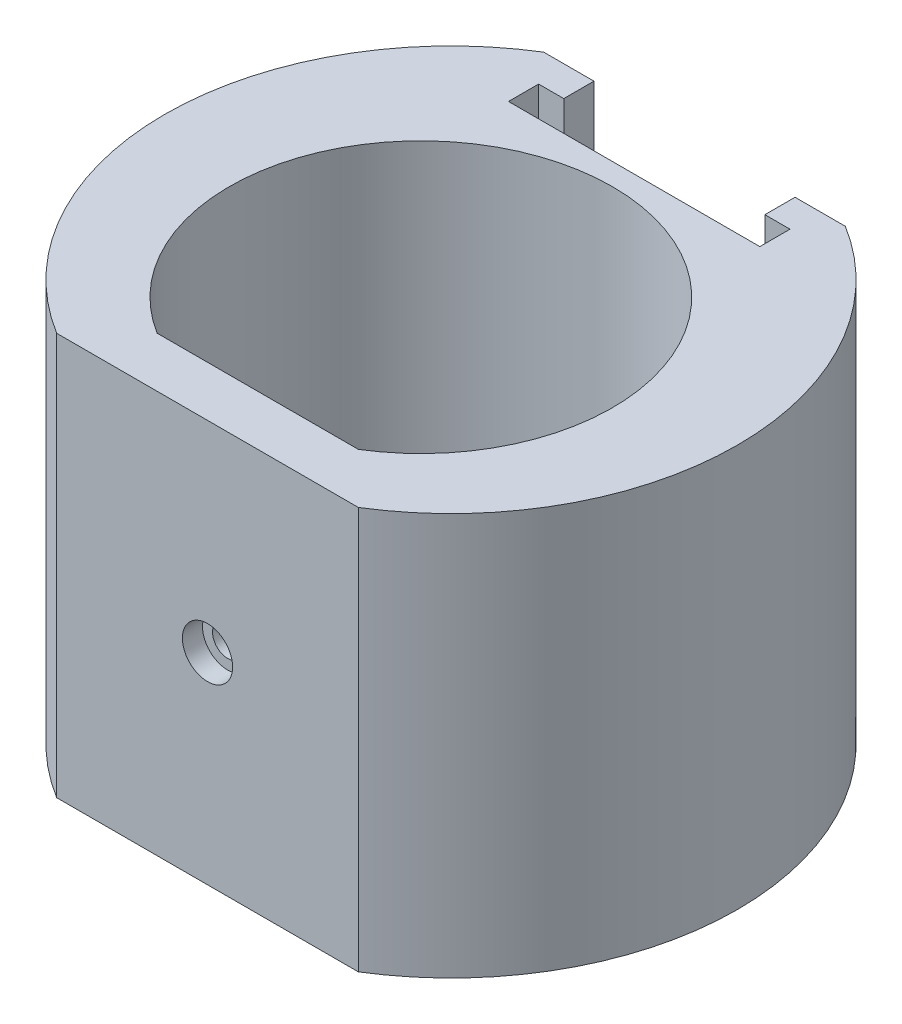
ISO-10303-21;
HEADER;
FILE_DESCRIPTION(('STEP AP214'),'2;1');
FILE_NAME('part.step','',(''),(''),'','','');
FILE_SCHEMA(('AUTOMOTIVE_DESIGN { 1 0 10303 214 1 1 1 1 }'));
ENDSEC;
DATA;
#1=APPLICATION_CONTEXT('core data for automotive mechanical design processes');
#2=APPLICATION_PROTOCOL_DEFINITION('international standard','automotive_design',2000,#1);
#3=PRODUCT_CONTEXT('',#1,'mechanical');
#4=PRODUCT('Part','Part','',(#3));
#5=PRODUCT_RELATED_PRODUCT_CATEGORY('part','',(#4));
#6=PRODUCT_DEFINITION_FORMATION('','',#4);
#7=PRODUCT_DEFINITION_CONTEXT('part definition',#1,'design');
#8=PRODUCT_DEFINITION('design','',#6,#7);
#9=PRODUCT_DEFINITION_SHAPE('','',#8);
#10=(LENGTH_UNIT() NAMED_UNIT(*) SI_UNIT(.MILLI.,.METRE.));
#11=(NAMED_UNIT(*) PLANE_ANGLE_UNIT() SI_UNIT($,.RADIAN.));
#12=(NAMED_UNIT(*) SI_UNIT($,.STERADIAN.) SOLID_ANGLE_UNIT());
#13=UNCERTAINTY_MEASURE_WITH_UNIT(LENGTH_MEASURE(1.E-05),#10,'distance_accuracy_value','');
#14=(GEOMETRIC_REPRESENTATION_CONTEXT(3) GLOBAL_UNCERTAINTY_ASSIGNED_CONTEXT((#13)) GLOBAL_UNIT_ASSIGNED_CONTEXT((#10,
#11,#12)) REPRESENTATION_CONTEXT('',''));
#15=CARTESIAN_POINT('',(0.,0.,0.));
#16=DIRECTION('',(0.,0.,1.));
#17=DIRECTION('',(1.,0.,0.));
#18=AXIS2_PLACEMENT_3D('',#15,#16,#17);
#19=CARTESIAN_POINT('',(0.,0.,19.2142684077944));
#20=DIRECTION('',(0.,0.,1.));
#21=DIRECTION('',(1.,0.,0.));
#22=AXIS2_PLACEMENT_3D('',#19,#20,#21);
#23=PLANE('',#22);
#24=CARTESIAN_POINT('',(0.,0.,19.2142684077944));
#25=DIRECTION('',(0.,0.,1.));
#26=DIRECTION('',(1.,0.,0.));
#27=AXIS2_PLACEMENT_3D('',#24,#25,#26);
#28=CIRCLE('',#27,2.5);
#29=CARTESIAN_POINT('',(2.5,0.,19.2142684077944));
#30=VERTEX_POINT('',#29);
#31=EDGE_CURVE('E192',#30,#30,#28,.T.);
#32=ORIENTED_EDGE('',*,*,#31,.T.);
#33=EDGE_LOOP('',(#32));
#34=FACE_BOUND('',#33,.T.);
#35=CARTESIAN_POINT('',(0.,0.,19.2142684077944));
#36=DIRECTION('',(0.,0.,1.));
#37=DIRECTION('',(1.,0.,0.));
#38=AXIS2_PLACEMENT_3D('',#35,#36,#37);
#39=CIRCLE('',#38,1.5);
#40=CARTESIAN_POINT('',(1.5,0.,19.2142684077944));
#41=VERTEX_POINT('',#40);
#42=EDGE_CURVE('E20',#41,#41,#39,.F.);
#43=ORIENTED_EDGE('',*,*,#42,.T.);
#44=EDGE_LOOP('',(#43));
#45=FACE_BOUND('',#44,.T.);
#46=ADVANCED_FACE('F17',(#34,#45),#23,.T.);
#47=CARTESIAN_POINT('',(0.,0.,11.9716277206751));
#48=DIRECTION('',(0.,0.,1.));
#49=DIRECTION('',(1.,0.,0.));
#50=AXIS2_PLACEMENT_3D('',#47,#48,#49);
#51=CYLINDRICAL_SURFACE('',#50,1.5);
#52=ORIENTED_EDGE('',*,*,#42,.F.);
#53=EDGE_LOOP('',(#52));
#54=FACE_BOUND('',#53,.T.);
#55=CARTESIAN_POINT('',(0.,0.,16.2142684077944));
#56=DIRECTION('',(0.,0.,1.));
#57=DIRECTION('',(1.,0.,0.));
#58=AXIS2_PLACEMENT_3D('',#55,#56,#57);
#59=CIRCLE('',#58,1.5);
#60=CARTESIAN_POINT('',(1.5,0.,16.2142684077944));
#61=VERTEX_POINT('',#60);
#62=EDGE_CURVE('E188',#61,#61,#59,.T.);
#63=ORIENTED_EDGE('',*,*,#62,.F.);
#64=EDGE_LOOP('',(#63));
#65=FACE_BOUND('',#64,.T.);
#66=ADVANCED_FACE('F202',(#54,#65),#51,.F.);
#67=CARTESIAN_POINT('',(0.,0.,19.2142684077944));
#68=DIRECTION('',(0.,0.,1.));
#69=DIRECTION('',(1.,0.,0.));
#70=AXIS2_PLACEMENT_3D('',#67,#68,#69);
#71=CYLINDRICAL_SURFACE('',#70,2.5);
#72=ORIENTED_EDGE('',*,*,#31,.F.);
#73=EDGE_LOOP('',(#72));
#74=FACE_BOUND('',#73,.T.);
#75=CARTESIAN_POINT('',(0.,0.,21.2142684077944));
#76=DIRECTION('',(0.,0.,1.));
#77=DIRECTION('',(1.,0.,0.));
#78=AXIS2_PLACEMENT_3D('',#75,#76,#77);
#79=CIRCLE('',#78,2.5);
#80=CARTESIAN_POINT('',(2.5,0.,21.2142684077944));
#81=VERTEX_POINT('',#80);
#82=EDGE_CURVE('E180',#81,#81,#79,.T.);
#83=ORIENTED_EDGE('',*,*,#82,.T.);
#84=EDGE_LOOP('',(#83));
#85=FACE_BOUND('',#84,.T.);
#86=ADVANCED_FACE('F205',(#74,#85),#71,.F.);
#87=CARTESIAN_POINT('',(12.5,-7.5,-24.2142684077944));
#88=DIRECTION('',(0.,0.,-1.));
#89=DIRECTION('',(-1.,0.,0.));
#90=AXIS2_PLACEMENT_3D('',#87,#88,#89);
#91=PLANE('',#90);
#92=DIRECTION('',(0.,1.,0.));
#93=VECTOR('',#92,1.);
#94=CARTESIAN_POINT('',(10.,-7.5,-24.2142684077944));
#95=LINE('',#94,#93);
#96=CARTESIAN_POINT('',(10.,20.,-24.2142684077944));
#97=VERTEX_POINT('',#96);
#98=CARTESIAN_POINT('',(10.,-7.5,-24.2142684077944));
#99=VERTEX_POINT('',#98);
#100=EDGE_CURVE('E84',#97,#99,#95,.F.);
#101=ORIENTED_EDGE('',*,*,#100,.T.);
#102=DIRECTION('',(1.,0.,0.));
#103=VECTOR('',#102,1.);
#104=CARTESIAN_POINT('',(0.,-7.5,-24.2142684077944));
#105=LINE('',#104,#103);
#106=CARTESIAN_POINT('',(12.5,-7.5,-24.2142684077944));
#107=VERTEX_POINT('',#106);
#108=EDGE_CURVE('E123',#107,#99,#105,.F.);
#109=ORIENTED_EDGE('',*,*,#108,.F.);
#110=DIRECTION('',(0.,1.,0.));
#111=VECTOR('',#110,1.);
#112=CARTESIAN_POINT('',(12.5,-7.5,-24.2142684077944));
#113=LINE('',#112,#111);
#114=CARTESIAN_POINT('',(12.5,20.,-24.2142684077944));
#115=VERTEX_POINT('',#114);
#116=EDGE_CURVE('E118',#107,#115,#113,.T.);
#117=ORIENTED_EDGE('',*,*,#116,.T.);
#118=DIRECTION('',(1.,0.,0.));
#119=VECTOR('',#118,1.);
#120=CARTESIAN_POINT('',(0.,20.,-24.2142684077944));
#121=LINE('',#120,#119);
#122=EDGE_CURVE('E126',#97,#115,#121,.T.);
#123=ORIENTED_EDGE('',*,*,#122,.F.);
#124=EDGE_LOOP('',(#101,#109,#117,#123));
#125=FACE_BOUND('',#124,.T.);
#126=ADVANCED_FACE('F121',(#125),#91,.F.);
#127=CARTESIAN_POINT('',(12.5,-7.5,-21.2142684077944));
#128=DIRECTION('',(1.,0.,0.));
#129=DIRECTION('',(0.,0.,-1.));
#130=AXIS2_PLACEMENT_3D('',#127,#128,#129);
#131=PLANE('',#130);
#132=ORIENTED_EDGE('',*,*,#116,.F.);
#133=DIRECTION('',(0.,0.,1.));
#134=VECTOR('',#133,1.);
#135=CARTESIAN_POINT('',(12.5,-7.5,0.));
#136=LINE('',#135,#134);
#137=CARTESIAN_POINT('',(12.5,-7.5,-21.2142684077944));
#138=VERTEX_POINT('',#137);
#139=EDGE_CURVE('E144',#138,#107,#136,.F.);
#140=ORIENTED_EDGE('',*,*,#139,.F.);
#141=DIRECTION('',(0.,1.,0.));
#142=VECTOR('',#141,1.);
#143=CARTESIAN_POINT('',(12.5,-7.5,-21.2142684077944));
#144=LINE('',#143,#142);
#145=CARTESIAN_POINT('',(12.5,20.,-21.2142684077944));
#146=VERTEX_POINT('',#145);
#147=EDGE_CURVE('E196',#138,#146,#144,.T.);
#148=ORIENTED_EDGE('',*,*,#147,.T.);
#149=DIRECTION('',(0.,0.,1.));
#150=VECTOR('',#149,1.);
#151=CARTESIAN_POINT('',(12.5,20.,-3.));
#152=LINE('',#151,#150);
#153=EDGE_CURVE('E306',#115,#146,#152,.T.);
#154=ORIENTED_EDGE('',*,*,#153,.F.);
#155=EDGE_LOOP('',(#132,#140,#148,#154));
#156=FACE_BOUND('',#155,.T.);
#157=ADVANCED_FACE('F381',(#156),#131,.F.);
#158=CARTESIAN_POINT('',(-12.5,-7.5,-21.2142684077944));
#159=DIRECTION('',(0.,0.,1.));
#160=DIRECTION('',(1.,0.,0.));
#161=AXIS2_PLACEMENT_3D('',#158,#159,#160);
#162=PLANE('',#161);
#163=ORIENTED_EDGE('',*,*,#147,.F.);
#164=DIRECTION('',(1.,0.,0.));
#165=VECTOR('',#164,1.);
#166=CARTESIAN_POINT('',(0.,-7.5,-21.2142684077944));
#167=LINE('',#166,#165);
#168=CARTESIAN_POINT('',(-12.5,-7.5,-21.2142684077944));
#169=VERTEX_POINT('',#168);
#170=EDGE_CURVE('E146',#169,#138,#167,.T.);
#171=ORIENTED_EDGE('',*,*,#170,.F.);
#172=DIRECTION('',(0.,1.,0.));
#173=VECTOR('',#172,1.);
#174=CARTESIAN_POINT('',(-12.5,-7.5,-21.2142684077944));
#175=LINE('',#174,#173);
#176=CARTESIAN_POINT('',(-12.5,20.,-21.2142684077944));
#177=VERTEX_POINT('',#176);
#178=EDGE_CURVE('E293',#169,#177,#175,.T.);
#179=ORIENTED_EDGE('',*,*,#178,.T.);
#180=DIRECTION('',(1.,0.,0.));
#181=VECTOR('',#180,1.);
#182=CARTESIAN_POINT('',(0.,20.,-21.2142684077944));
#183=LINE('',#182,#181);
#184=EDGE_CURVE('E298',#146,#177,#183,.F.);
#185=ORIENTED_EDGE('',*,*,#184,.F.);
#186=EDGE_LOOP('',(#163,#171,#179,#185));
#187=FACE_BOUND('',#186,.T.);
#188=ADVANCED_FACE('F386',(#187),#162,.F.);
#189=CARTESIAN_POINT('',(-12.5,-7.5,-24.2142684077944));
#190=DIRECTION('',(-1.,0.,0.));
#191=DIRECTION('',(0.,0.,1.));
#192=AXIS2_PLACEMENT_3D('',#189,#190,#191);
#193=PLANE('',#192);
#194=ORIENTED_EDGE('',*,*,#178,.F.);
#195=DIRECTION('',(0.,0.,1.));
#196=VECTOR('',#195,1.);
#197=CARTESIAN_POINT('',(-12.5,-7.5,0.));
#198=LINE('',#197,#196);
#199=CARTESIAN_POINT('',(-12.5,-7.5,-24.2142684077944));
#200=VERTEX_POINT('',#199);
#201=EDGE_CURVE('E153',#200,#169,#198,.T.);
#202=ORIENTED_EDGE('',*,*,#201,.F.);
#203=DIRECTION('',(0.,1.,0.));
#204=VECTOR('',#203,1.);
#205=CARTESIAN_POINT('',(-12.5,-7.5,-24.2142684077944));
#206=LINE('',#205,#204);
#207=CARTESIAN_POINT('',(-12.5,20.,-24.2142684077944));
#208=VERTEX_POINT('',#207);
#209=EDGE_CURVE('E191',#200,#208,#206,.T.);
#210=ORIENTED_EDGE('',*,*,#209,.T.);
#211=DIRECTION('',(0.,0.,1.));
#212=VECTOR('',#211,1.);
#213=CARTESIAN_POINT('',(-12.5,20.,-3.));
#214=LINE('',#213,#212);
#215=EDGE_CURVE('E289',#177,#208,#214,.F.);
#216=ORIENTED_EDGE('',*,*,#215,.F.);
#217=EDGE_LOOP('',(#194,#202,#210,#216));
#218=FACE_BOUND('',#217,.T.);
#219=ADVANCED_FACE('F222',(#218),#193,.F.);
#220=CARTESIAN_POINT('',(-10.,-7.5,-24.2142684077944));
#221=DIRECTION('',(0.,0.,-1.));
#222=DIRECTION('',(-1.,0.,0.));
#223=AXIS2_PLACEMENT_3D('',#220,#221,#222);
#224=PLANE('',#223);
#225=ORIENTED_EDGE('',*,*,#209,.F.);
#226=DIRECTION('',(1.,0.,0.));
#227=VECTOR('',#226,1.);
#228=CARTESIAN_POINT('',(0.,-7.5,-24.2142684077944));
#229=LINE('',#228,#227);
#230=CARTESIAN_POINT('',(-10.,-7.5,-24.2142684077944));
#231=VERTEX_POINT('',#230);
#232=EDGE_CURVE('E156',#231,#200,#229,.F.);
#233=ORIENTED_EDGE('',*,*,#232,.F.);
#234=DIRECTION('',(0.,1.,0.));
#235=VECTOR('',#234,1.);
#236=CARTESIAN_POINT('',(-10.,-7.5,-24.2142684077944));
#237=LINE('',#236,#235);
#238=CARTESIAN_POINT('',(-10.,20.,-24.2142684077944));
#239=VERTEX_POINT('',#238);
#240=EDGE_CURVE('E129',#231,#239,#237,.T.);
#241=ORIENTED_EDGE('',*,*,#240,.T.);
#242=DIRECTION('',(1.,0.,0.));
#243=VECTOR('',#242,1.);
#244=CARTESIAN_POINT('',(0.,20.,-24.2142684077944));
#245=LINE('',#244,#243);
#246=EDGE_CURVE('E287',#208,#239,#245,.T.);
#247=ORIENTED_EDGE('',*,*,#246,.F.);
#248=EDGE_LOOP('',(#225,#233,#241,#247));
#249=FACE_BOUND('',#248,.T.);
#250=ADVANCED_FACE('F211',(#249),#224,.F.);
#251=CARTESIAN_POINT('',(-10.,20.,16.2142684077944));
#252=DIRECTION('',(0.,0.,-1.));
#253=DIRECTION('',(-1.,0.,0.));
#254=AXIS2_PLACEMENT_3D('',#251,#252,#253);
#255=PLANE('',#254);
#256=DIRECTION('',(1.,0.,0.));
#257=VECTOR('',#256,1.);
#258=CARTESIAN_POINT('',(0.,20.,16.2142684077944));
#259=LINE('',#258,#257);
#260=CARTESIAN_POINT('',(10.,20.,16.2142684077944));
#261=VERTEX_POINT('',#260);
#262=CARTESIAN_POINT('',(-10.,20.,16.2142684077944));
#263=VERTEX_POINT('',#262);
#264=EDGE_CURVE('E175',#261,#263,#259,.F.);
#265=ORIENTED_EDGE('',*,*,#264,.F.);
#266=DIRECTION('',(0.,-1.,0.));
#267=VECTOR('',#266,1.);
#268=CARTESIAN_POINT('',(10.,20.,16.2142684077944));
#269=LINE('',#268,#267);
#270=CARTESIAN_POINT('',(10.,-20.,16.2142684077944));
#271=VERTEX_POINT('',#270);
#272=EDGE_CURVE('E267',#261,#271,#269,.T.);
#273=ORIENTED_EDGE('',*,*,#272,.T.);
#274=DIRECTION('',(1.,0.,0.));
#275=VECTOR('',#274,1.);
#276=CARTESIAN_POINT('',(0.,-20.,16.2142684077944));
#277=LINE('',#276,#275);
#278=CARTESIAN_POINT('',(-10.,-20.,16.2142684077944));
#279=VERTEX_POINT('',#278);
#280=EDGE_CURVE('E186',#271,#279,#277,.F.);
#281=ORIENTED_EDGE('',*,*,#280,.T.);
#282=DIRECTION('',(0.,-1.,0.));
#283=VECTOR('',#282,1.);
#284=CARTESIAN_POINT('',(-10.,20.,16.2142684077944));
#285=LINE('',#284,#283);
#286=EDGE_CURVE('E190',#279,#263,#285,.F.);
#287=ORIENTED_EDGE('',*,*,#286,.T.);
#288=EDGE_LOOP('',(#265,#273,#281,#287));
#289=FACE_BOUND('',#288,.T.);
#290=ORIENTED_EDGE('',*,*,#62,.T.);
#291=EDGE_LOOP('',(#290));
#292=FACE_BOUND('',#291,.T.);
#293=ADVANCED_FACE('F208',(#289,#292),#255,.T.);
#294=CARTESIAN_POINT('',(0.,20.,0.));
#295=DIRECTION('',(0.,-1.,0.));
#296=DIRECTION('',(0.,0.,-1.));
#297=AXIS2_PLACEMENT_3D('',#294,#295,#296);
#298=CYLINDRICAL_SURFACE('',#297,19.05);
#299=CARTESIAN_POINT('',(0.,20.,0.));
#300=DIRECTION('',(0.,-1.,0.));
#301=DIRECTION('',(0.,0.,-1.));
#302=AXIS2_PLACEMENT_3D('',#299,#300,#301);
#303=CIRCLE('',#302,19.05);
#304=EDGE_CURVE('E171',#263,#261,#303,.T.);
#305=ORIENTED_EDGE('',*,*,#304,.F.);
#306=ORIENTED_EDGE('',*,*,#286,.F.);
#307=CARTESIAN_POINT('',(0.,-20.,0.));
#308=DIRECTION('',(0.,-1.,0.));
#309=DIRECTION('',(0.,0.,-1.));
#310=AXIS2_PLACEMENT_3D('',#307,#308,#309);
#311=CIRCLE('',#310,19.05);
#312=EDGE_CURVE('E183',#279,#271,#311,.T.);
#313=ORIENTED_EDGE('',*,*,#312,.T.);
#314=ORIENTED_EDGE('',*,*,#272,.F.);
#315=EDGE_LOOP('',(#305,#306,#313,#314));
#316=FACE_BOUND('',#315,.T.);
#317=ADVANCED_FACE('F210',(#316),#298,.F.);
#318=CARTESIAN_POINT('',(-10.,-7.5,-27.2142684077944));
#319=DIRECTION('',(-1.,0.,0.));
#320=DIRECTION('',(0.,0.,1.));
#321=AXIS2_PLACEMENT_3D('',#318,#319,#320);
#322=PLANE('',#321);
#323=ORIENTED_EDGE('',*,*,#240,.F.);
#324=DIRECTION('',(0.,0.,1.));
#325=VECTOR('',#324,1.);
#326=CARTESIAN_POINT('',(-10.,-7.5,0.));
#327=LINE('',#326,#325);
#328=CARTESIAN_POINT('',(-10.,-7.5,-27.2142684077944));
#329=VERTEX_POINT('',#328);
#330=EDGE_CURVE('E128',#329,#231,#327,.T.);
#331=ORIENTED_EDGE('',*,*,#330,.F.);
#332=DIRECTION('',(0.,1.,0.));
#333=VECTOR('',#332,1.);
#334=CARTESIAN_POINT('',(-10.,20.,-27.2142684077944));
#335=LINE('',#334,#333);
#336=CARTESIAN_POINT('',(-10.,20.,-27.2142684077944));
#337=VERTEX_POINT('',#336);
#338=EDGE_CURVE('E174',#329,#337,#335,.T.);
#339=ORIENTED_EDGE('',*,*,#338,.T.);
#340=DIRECTION('',(0.,0.,1.));
#341=VECTOR('',#340,1.);
#342=CARTESIAN_POINT('',(-10.,20.,-3.));
#343=LINE('',#342,#341);
#344=EDGE_CURVE('E264',#239,#337,#343,.F.);
#345=ORIENTED_EDGE('',*,*,#344,.F.);
#346=EDGE_LOOP('',(#323,#331,#339,#345));
#347=FACE_BOUND('',#346,.T.);
#348=ADVANCED_FACE('F219',(#347),#322,.F.);
#349=CARTESIAN_POINT('',(0.,20.,-3.));
#350=DIRECTION('',(0.,-1.,0.));
#351=DIRECTION('',(0.,0.,-1.));
#352=AXIS2_PLACEMENT_3D('',#349,#350,#351);
#353=CYLINDRICAL_SURFACE('',#352,28.4838690230929);
#354=CARTESIAN_POINT('',(0.,20.,-3.));
#355=DIRECTION('',(0.,-1.,0.));
#356=DIRECTION('',(0.,0.,-1.));
#357=AXIS2_PLACEMENT_3D('',#354,#355,#356);
#358=CIRCLE('',#357,28.4838690230929);
#359=CARTESIAN_POINT('',(15.,20.,21.2142684077944));
#360=VERTEX_POINT('',#359);
#361=CARTESIAN_POINT('',(15.,20.,-27.2142684077944));
#362=VERTEX_POINT('',#361);
#363=EDGE_CURVE('E176',#360,#362,#358,.F.);
#364=ORIENTED_EDGE('',*,*,#363,.F.);
#365=DIRECTION('',(0.,1.,0.));
#366=VECTOR('',#365,1.);
#367=CARTESIAN_POINT('',(15.,20.,21.2142684077944));
#368=LINE('',#367,#366);
#369=CARTESIAN_POINT('',(15.,-20.,21.2142684077944));
#370=VERTEX_POINT('',#369);
#371=EDGE_CURVE('E75',#360,#370,#368,.F.);
#372=ORIENTED_EDGE('',*,*,#371,.T.);
#373=CARTESIAN_POINT('',(0.,-20.,-3.));
#374=DIRECTION('',(0.,-1.,0.));
#375=DIRECTION('',(0.,0.,-1.));
#376=AXIS2_PLACEMENT_3D('',#373,#374,#375);
#377=CIRCLE('',#376,28.4838690230929);
#378=CARTESIAN_POINT('',(15.,-20.,-27.2142684077944));
#379=VERTEX_POINT('',#378);
#380=EDGE_CURVE('E140',#370,#379,#377,.F.);
#381=ORIENTED_EDGE('',*,*,#380,.T.);
#382=DIRECTION('',(0.,1.,0.));
#383=VECTOR('',#382,1.);
#384=CARTESIAN_POINT('',(15.,20.,-27.2142684077944));
#385=LINE('',#384,#383);
#386=EDGE_CURVE('E347',#379,#362,#385,.T.);
#387=ORIENTED_EDGE('',*,*,#386,.T.);
#388=EDGE_LOOP('',(#364,#372,#381,#387));
#389=FACE_BOUND('',#388,.T.);
#390=ADVANCED_FACE('F252',(#389),#353,.T.);
#391=CARTESIAN_POINT('',(10.,-7.5,-24.2142684077944));
#392=DIRECTION('',(1.,0.,0.));
#393=DIRECTION('',(0.,0.,-1.));
#394=AXIS2_PLACEMENT_3D('',#391,#392,#393);
#395=PLANE('',#394);
#396=DIRECTION('',(0.,1.,0.));
#397=VECTOR('',#396,1.);
#398=CARTESIAN_POINT('',(10.,20.,-27.2142684077944));
#399=LINE('',#398,#397);
#400=CARTESIAN_POINT('',(10.,20.,-27.2142684077944));
#401=VERTEX_POINT('',#400);
#402=CARTESIAN_POINT('',(10.,-7.5,-27.2142684077944));
#403=VERTEX_POINT('',#402);
#404=EDGE_CURVE('E136',#401,#403,#399,.F.);
#405=ORIENTED_EDGE('',*,*,#404,.T.);
#406=DIRECTION('',(0.,0.,1.));
#407=VECTOR('',#406,1.);
#408=CARTESIAN_POINT('',(10.,-7.5,0.));
#409=LINE('',#408,#407);
#410=EDGE_CURVE('E133',#99,#403,#409,.F.);
#411=ORIENTED_EDGE('',*,*,#410,.F.);
#412=ORIENTED_EDGE('',*,*,#100,.F.);
#413=DIRECTION('',(0.,0.,1.));
#414=VECTOR('',#413,1.);
#415=CARTESIAN_POINT('',(10.,20.,-3.));
#416=LINE('',#415,#414);
#417=EDGE_CURVE('E319',#401,#97,#416,.T.);
#418=ORIENTED_EDGE('',*,*,#417,.F.);
#419=EDGE_LOOP('',(#405,#411,#412,#418));
#420=FACE_BOUND('',#419,.T.);
#421=ADVANCED_FACE('F134',(#420),#395,.F.);
#422=CARTESIAN_POINT('',(0.,-7.5,0.));
#423=DIRECTION('',(0.,1.,0.));
#424=DIRECTION('',(0.,0.,1.));
#425=AXIS2_PLACEMENT_3D('',#422,#423,#424);
#426=PLANE('',#425);
#427=ORIENTED_EDGE('',*,*,#108,.T.);
#428=ORIENTED_EDGE('',*,*,#410,.T.);
#429=DIRECTION('',(1.,0.,0.));
#430=VECTOR('',#429,1.);
#431=CARTESIAN_POINT('',(-15.,-7.5,-27.2142684077944));
#432=LINE('',#431,#430);
#433=EDGE_CURVE('E170',#403,#329,#432,.F.);
#434=ORIENTED_EDGE('',*,*,#433,.T.);
#435=ORIENTED_EDGE('',*,*,#330,.T.);
#436=ORIENTED_EDGE('',*,*,#232,.T.);
#437=ORIENTED_EDGE('',*,*,#201,.T.);
#438=ORIENTED_EDGE('',*,*,#170,.T.);
#439=ORIENTED_EDGE('',*,*,#139,.T.);
#440=EDGE_LOOP('',(#427,#428,#434,#435,#436,#437,#438,#439));
#441=FACE_BOUND('',#440,.T.);
#442=ADVANCED_FACE('F142',(#441),#426,.T.);
#443=CARTESIAN_POINT('',(0.,-20.,-3.));
#444=DIRECTION('',(0.,1.,0.));
#445=DIRECTION('',(0.,0.,1.));
#446=AXIS2_PLACEMENT_3D('',#443,#444,#445);
#447=PLANE('',#446);
#448=ORIENTED_EDGE('',*,*,#312,.F.);
#449=ORIENTED_EDGE('',*,*,#280,.F.);
#450=EDGE_LOOP('',(#448,#449));
#451=FACE_BOUND('',#450,.T.);
#452=DIRECTION('',(-1.,0.,0.));
#453=VECTOR('',#452,1.);
#454=CARTESIAN_POINT('',(-15.,-20.,21.2142684077944));
#455=LINE('',#454,#453);
#456=CARTESIAN_POINT('',(-15.,-20.,21.2142684077944));
#457=VERTEX_POINT('',#456);
#458=EDGE_CURVE('E283',#370,#457,#455,.T.);
#459=ORIENTED_EDGE('',*,*,#458,.T.);
#460=CARTESIAN_POINT('',(0.,-20.,-3.));
#461=DIRECTION('',(0.,-1.,0.));
#462=DIRECTION('',(0.,0.,-1.));
#463=AXIS2_PLACEMENT_3D('',#460,#461,#462);
#464=CIRCLE('',#463,28.4838690230929);
#465=CARTESIAN_POINT('',(-15.,-20.,-27.2142684077944));
#466=VERTEX_POINT('',#465);
#467=EDGE_CURVE('E167',#466,#457,#464,.F.);
#468=ORIENTED_EDGE('',*,*,#467,.F.);
#469=DIRECTION('',(1.,0.,0.));
#470=VECTOR('',#469,1.);
#471=CARTESIAN_POINT('',(-15.,-20.,-27.2142684077944));
#472=LINE('',#471,#470);
#473=EDGE_CURVE('E344',#466,#379,#472,.T.);
#474=ORIENTED_EDGE('',*,*,#473,.T.);
#475=ORIENTED_EDGE('',*,*,#380,.F.);
#476=EDGE_LOOP('',(#459,#468,#474,#475));
#477=FACE_BOUND('',#476,.T.);
#478=ADVANCED_FACE('F243',(#451,#477),#447,.F.);
#479=CARTESIAN_POINT('',(-15.,20.,21.2142684077944));
#480=DIRECTION('',(0.,0.,-1.));
#481=DIRECTION('',(-1.,0.,0.));
#482=AXIS2_PLACEMENT_3D('',#479,#480,#481);
#483=PLANE('',#482);
#484=ORIENTED_EDGE('',*,*,#371,.F.);
#485=DIRECTION('',(1.,0.,0.));
#486=VECTOR('',#485,1.);
#487=CARTESIAN_POINT('',(0.,20.,21.2142684077944));
#488=LINE('',#487,#486);
#489=CARTESIAN_POINT('',(-15.,20.,21.2142684077944));
#490=VERTEX_POINT('',#489);
#491=EDGE_CURVE('E179',#490,#360,#488,.T.);
#492=ORIENTED_EDGE('',*,*,#491,.F.);
#493=DIRECTION('',(0.,-1.,0.));
#494=VECTOR('',#493,1.);
#495=CARTESIAN_POINT('',(-15.,20.,21.2142684077944));
#496=LINE('',#495,#494);
#497=EDGE_CURVE('E166',#457,#490,#496,.F.);
#498=ORIENTED_EDGE('',*,*,#497,.F.);
#499=ORIENTED_EDGE('',*,*,#458,.F.);
#500=EDGE_LOOP('',(#484,#492,#498,#499));
#501=FACE_BOUND('',#500,.T.);
#502=ORIENTED_EDGE('',*,*,#82,.F.);
#503=EDGE_LOOP('',(#502));
#504=FACE_BOUND('',#503,.T.);
#505=ADVANCED_FACE('F239',(#501,#504),#483,.F.);
#506=CARTESIAN_POINT('',(0.,20.,-3.));
#507=DIRECTION('',(0.,1.,0.));
#508=DIRECTION('',(0.,0.,1.));
#509=AXIS2_PLACEMENT_3D('',#506,#507,#508);
#510=PLANE('',#509);
#511=ORIENTED_EDGE('',*,*,#264,.T.);
#512=ORIENTED_EDGE('',*,*,#304,.T.);
#513=EDGE_LOOP('',(#511,#512));
#514=FACE_BOUND('',#513,.T.);
#515=ORIENTED_EDGE('',*,*,#363,.T.);
#516=DIRECTION('',(1.,0.,0.));
#517=VECTOR('',#516,1.);
#518=CARTESIAN_POINT('',(-15.,20.,-27.2142684077944));
#519=LINE('',#518,#517);
#520=EDGE_CURVE('E335',#362,#401,#519,.F.);
#521=ORIENTED_EDGE('',*,*,#520,.T.);
#522=ORIENTED_EDGE('',*,*,#417,.T.);
#523=ORIENTED_EDGE('',*,*,#122,.T.);
#524=ORIENTED_EDGE('',*,*,#153,.T.);
#525=ORIENTED_EDGE('',*,*,#184,.T.);
#526=ORIENTED_EDGE('',*,*,#215,.T.);
#527=ORIENTED_EDGE('',*,*,#246,.T.);
#528=ORIENTED_EDGE('',*,*,#344,.T.);
#529=DIRECTION('',(1.,0.,0.));
#530=VECTOR('',#529,1.);
#531=CARTESIAN_POINT('',(-15.,20.,-27.2142684077944));
#532=LINE('',#531,#530);
#533=CARTESIAN_POINT('',(-15.,20.,-27.2142684077944));
#534=VERTEX_POINT('',#533);
#535=EDGE_CURVE('E35',#337,#534,#532,.F.);
#536=ORIENTED_EDGE('',*,*,#535,.T.);
#537=CARTESIAN_POINT('',(0.,20.,-3.));
#538=DIRECTION('',(0.,-1.,0.));
#539=DIRECTION('',(0.,0.,-1.));
#540=AXIS2_PLACEMENT_3D('',#537,#538,#539);
#541=CIRCLE('',#540,28.4838690230929);
#542=EDGE_CURVE('E26',#490,#534,#541,.T.);
#543=ORIENTED_EDGE('',*,*,#542,.F.);
#544=ORIENTED_EDGE('',*,*,#491,.T.);
#545=EDGE_LOOP('',(#515,#521,#522,#523,#524,#525,#526,#527,#528,#536,#543,#544));
#546=FACE_BOUND('',#545,.T.);
#547=ADVANCED_FACE('F233',(#514,#546),#510,.T.);
#548=CARTESIAN_POINT('',(-15.,20.,-27.2142684077944));
#549=DIRECTION('',(0.,0.,1.));
#550=DIRECTION('',(1.,0.,0.));
#551=AXIS2_PLACEMENT_3D('',#548,#549,#550);
#552=PLANE('',#551);
#553=ORIENTED_EDGE('',*,*,#404,.F.);
#554=ORIENTED_EDGE('',*,*,#520,.F.);
#555=ORIENTED_EDGE('',*,*,#386,.F.);
#556=ORIENTED_EDGE('',*,*,#473,.F.);
#557=DIRECTION('',(0.,-1.,0.));
#558=VECTOR('',#557,1.);
#559=CARTESIAN_POINT('',(-15.,20.,-27.2142684077944));
#560=LINE('',#559,#558);
#561=EDGE_CURVE('E11',#534,#466,#560,.T.);
#562=ORIENTED_EDGE('',*,*,#561,.F.);
#563=ORIENTED_EDGE('',*,*,#535,.F.);
#564=ORIENTED_EDGE('',*,*,#338,.F.);
#565=ORIENTED_EDGE('',*,*,#433,.F.);
#566=EDGE_LOOP('',(#553,#554,#555,#556,#562,#563,#564,#565));
#567=FACE_BOUND('',#566,.T.);
#568=ADVANCED_FACE('F227',(#567),#552,.F.);
#569=CARTESIAN_POINT('',(0.,20.,-3.));
#570=DIRECTION('',(0.,-1.,0.));
#571=DIRECTION('',(0.,0.,-1.));
#572=AXIS2_PLACEMENT_3D('',#569,#570,#571);
#573=CYLINDRICAL_SURFACE('',#572,28.4838690230929);
#574=ORIENTED_EDGE('',*,*,#542,.T.);
#575=ORIENTED_EDGE('',*,*,#561,.T.);
#576=ORIENTED_EDGE('',*,*,#467,.T.);
#577=ORIENTED_EDGE('',*,*,#497,.T.);
#578=EDGE_LOOP('',(#574,#575,#576,#577));
#579=FACE_BOUND('',#578,.T.);
#580=ADVANCED_FACE('F225',(#579),#573,.T.);
#581=CLOSED_SHELL('',(#46,#66,#86,#126,#157,#188,#219,#250,#293,#317,#348,#390,#421,#442,#478,
#505,#547,#568,#580));
#582=MANIFOLD_SOLID_BREP('B1',#581);
#583=ADVANCED_BREP_SHAPE_REPRESENTATION('',(#18,#582),#14);
#584=SHAPE_DEFINITION_REPRESENTATION(#9,#583);
ENDSEC;
END-ISO-10303-21;
